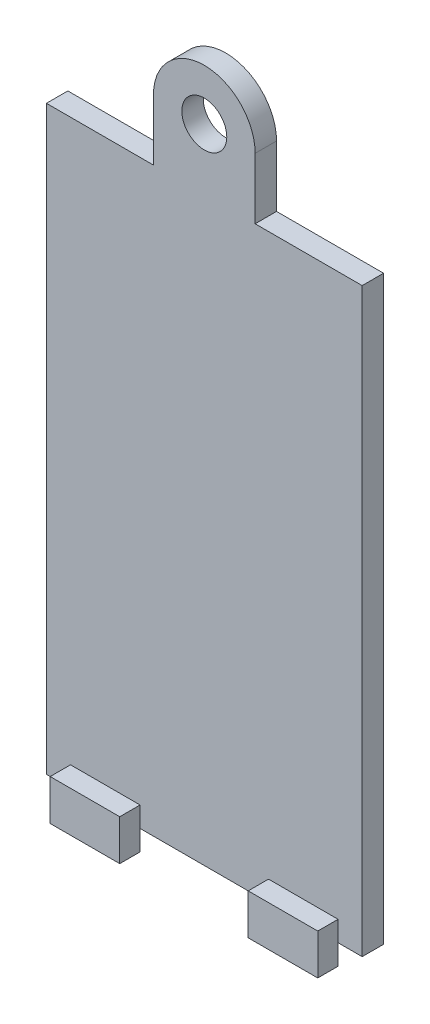
ISO-10303-21;
HEADER;
FILE_DESCRIPTION(('STEP AP214'),'2;1');
FILE_NAME('part.step','',(''),(''),'','','');
FILE_SCHEMA(('AUTOMOTIVE_DESIGN { 1 0 10303 214 1 1 1 1 }'));
ENDSEC;
DATA;
#1=APPLICATION_CONTEXT('core data for automotive mechanical design processes');
#2=APPLICATION_PROTOCOL_DEFINITION('international standard','automotive_design',2000,#1);
#3=PRODUCT_CONTEXT('',#1,'mechanical');
#4=PRODUCT('Part','Part','',(#3));
#5=PRODUCT_RELATED_PRODUCT_CATEGORY('part','',(#4));
#6=PRODUCT_DEFINITION_FORMATION('','',#4);
#7=PRODUCT_DEFINITION_CONTEXT('part definition',#1,'design');
#8=PRODUCT_DEFINITION('design','',#6,#7);
#9=PRODUCT_DEFINITION_SHAPE('','',#8);
#10=(LENGTH_UNIT() NAMED_UNIT(*) SI_UNIT(.MILLI.,.METRE.));
#11=(NAMED_UNIT(*) PLANE_ANGLE_UNIT() SI_UNIT($,.RADIAN.));
#12=(NAMED_UNIT(*) SI_UNIT($,.STERADIAN.) SOLID_ANGLE_UNIT());
#13=UNCERTAINTY_MEASURE_WITH_UNIT(LENGTH_MEASURE(1.E-05),#10,'distance_accuracy_value','');
#14=(GEOMETRIC_REPRESENTATION_CONTEXT(3) GLOBAL_UNCERTAINTY_ASSIGNED_CONTEXT((#13)) GLOBAL_UNIT_ASSIGNED_CONTEXT((#10,
#11,#12)) REPRESENTATION_CONTEXT('',''));
#15=CARTESIAN_POINT('',(0.,0.,0.));
#16=DIRECTION('',(0.,0.,1.));
#17=DIRECTION('',(1.,0.,0.));
#18=AXIS2_PLACEMENT_3D('',#15,#16,#17);
#19=CARTESIAN_POINT('',(0.,0.,2.));
#20=DIRECTION('',(0.,0.,-1.));
#21=DIRECTION('',(-1.,0.,0.));
#22=AXIS2_PLACEMENT_3D('',#19,#20,#21);
#23=PLANE('',#22);
#24=DIRECTION('',(0.,-1.,0.));
#25=VECTOR('',#24,1.);
#26=CARTESIAN_POINT('',(-4.75,32.75,2.));
#27=LINE('',#26,#25);
#28=CARTESIAN_POINT('',(-4.75,32.75,2.));
#29=VERTEX_POINT('',#28);
#30=CARTESIAN_POINT('',(-4.75,27.05,2.));
#31=VERTEX_POINT('',#30);
#32=EDGE_CURVE('E170',#29,#31,#27,.T.);
#33=ORIENTED_EDGE('',*,*,#32,.T.);
#34=DIRECTION('',(1.,0.,0.));
#35=VECTOR('',#34,1.);
#36=CARTESIAN_POINT('',(-4.75,27.05,2.));
#37=LINE('',#36,#35);
#38=CARTESIAN_POINT('',(-14.75,27.05,2.));
#39=VERTEX_POINT('',#38);
#40=EDGE_CURVE('E174',#39,#31,#37,.T.);
#41=ORIENTED_EDGE('',*,*,#40,.F.);
#42=DIRECTION('',(0.,-1.,0.));
#43=VECTOR('',#42,1.);
#44=CARTESIAN_POINT('',(-14.75,-27.25,2.));
#45=LINE('',#44,#43);
#46=CARTESIAN_POINT('',(-14.75,-27.25,2.));
#47=VERTEX_POINT('',#46);
#48=EDGE_CURVE('E336',#39,#47,#45,.T.);
#49=ORIENTED_EDGE('',*,*,#48,.T.);
#50=DIRECTION('',(1.,0.,0.));
#51=VECTOR('',#50,1.);
#52=CARTESIAN_POINT('',(14.75,-27.25,2.));
#53=LINE('',#52,#51);
#54=CARTESIAN_POINT('',(-12.5,-27.25,2.));
#55=VERTEX_POINT('',#54);
#56=EDGE_CURVE('E326',#47,#55,#53,.T.);
#57=ORIENTED_EDGE('',*,*,#56,.T.);
#58=DIRECTION('',(0.,1.,0.));
#59=VECTOR('',#58,1.);
#60=CARTESIAN_POINT('',(-12.5,-29.15,2.));
#61=LINE('',#60,#59);
#62=CARTESIAN_POINT('',(-12.5,-25.35,2.));
#63=VERTEX_POINT('',#62);
#64=EDGE_CURVE('E325',#55,#63,#61,.T.);
#65=ORIENTED_EDGE('',*,*,#64,.T.);
#66=DIRECTION('',(1.,0.,0.));
#67=VECTOR('',#66,1.);
#68=CARTESIAN_POINT('',(-12.5,-25.35,2.));
#69=LINE('',#68,#67);
#70=CARTESIAN_POINT('',(-6.,-25.35,2.));
#71=VERTEX_POINT('',#70);
#72=EDGE_CURVE('E299',#63,#71,#69,.T.);
#73=ORIENTED_EDGE('',*,*,#72,.T.);
#74=DIRECTION('',(0.,1.,0.));
#75=VECTOR('',#74,1.);
#76=CARTESIAN_POINT('',(-6.,-29.15,2.));
#77=LINE('',#76,#75);
#78=CARTESIAN_POINT('',(-6.,-27.25,2.));
#79=VERTEX_POINT('',#78);
#80=EDGE_CURVE('E320',#79,#71,#77,.T.);
#81=ORIENTED_EDGE('',*,*,#80,.F.);
#82=CARTESIAN_POINT('',(6.,-27.25,2.));
#83=VERTEX_POINT('',#82);
#84=EDGE_CURVE('E380',#79,#83,#53,.T.);
#85=ORIENTED_EDGE('',*,*,#84,.T.);
#86=DIRECTION('',(0.,1.,0.));
#87=VECTOR('',#86,1.);
#88=CARTESIAN_POINT('',(6.,-29.15,2.));
#89=LINE('',#88,#87);
#90=CARTESIAN_POINT('',(6.,-25.35,2.));
#91=VERTEX_POINT('',#90);
#92=EDGE_CURVE('E66',#83,#91,#89,.T.);
#93=ORIENTED_EDGE('',*,*,#92,.T.);
#94=DIRECTION('',(1.,0.,0.));
#95=VECTOR('',#94,1.);
#96=CARTESIAN_POINT('',(6.,-25.35,2.));
#97=LINE('',#96,#95);
#98=CARTESIAN_POINT('',(12.5,-25.35,2.));
#99=VERTEX_POINT('',#98);
#100=EDGE_CURVE('E61',#91,#99,#97,.T.);
#101=ORIENTED_EDGE('',*,*,#100,.T.);
#102=DIRECTION('',(0.,1.,0.));
#103=VECTOR('',#102,1.);
#104=CARTESIAN_POINT('',(12.5,-29.15,2.));
#105=LINE('',#104,#103);
#106=CARTESIAN_POINT('',(12.5,-27.25,2.));
#107=VERTEX_POINT('',#106);
#108=EDGE_CURVE('E272',#107,#99,#105,.T.);
#109=ORIENTED_EDGE('',*,*,#108,.F.);
#110=CARTESIAN_POINT('',(14.75,-27.25,2.));
#111=VERTEX_POINT('',#110);
#112=EDGE_CURVE('E332',#107,#111,#53,.T.);
#113=ORIENTED_EDGE('',*,*,#112,.T.);
#114=DIRECTION('',(0.,1.,0.));
#115=VECTOR('',#114,1.);
#116=CARTESIAN_POINT('',(14.75,-27.25,2.));
#117=LINE('',#116,#115);
#118=CARTESIAN_POINT('',(14.75,27.05,2.));
#119=VERTEX_POINT('',#118);
#120=EDGE_CURVE('E330',#111,#119,#117,.T.);
#121=ORIENTED_EDGE('',*,*,#120,.T.);
#122=DIRECTION('',(1.,0.,0.));
#123=VECTOR('',#122,1.);
#124=CARTESIAN_POINT('',(4.75,27.05,2.));
#125=LINE('',#124,#123);
#126=CARTESIAN_POINT('',(4.75,27.05,2.));
#127=VERTEX_POINT('',#126);
#128=EDGE_CURVE('E197',#127,#119,#125,.T.);
#129=ORIENTED_EDGE('',*,*,#128,.F.);
#130=DIRECTION('',(0.,1.,0.));
#131=VECTOR('',#130,1.);
#132=CARTESIAN_POINT('',(4.75,27.25,2.));
#133=LINE('',#132,#131);
#134=CARTESIAN_POINT('',(4.75,32.75,2.));
#135=VERTEX_POINT('',#134);
#136=EDGE_CURVE('E181',#127,#135,#133,.T.);
#137=ORIENTED_EDGE('',*,*,#136,.T.);
#138=CARTESIAN_POINT('',(0.,32.75,2.));
#139=DIRECTION('',(0.,0.,1.));
#140=DIRECTION('',(1.,0.,0.));
#141=AXIS2_PLACEMENT_3D('',#138,#139,#140);
#142=CIRCLE('',#141,4.75);
#143=EDGE_CURVE('E178',#135,#29,#142,.T.);
#144=ORIENTED_EDGE('',*,*,#143,.T.);
#145=EDGE_LOOP('',(#33,#41,#49,#57,#65,#73,#81,#85,#93,#101,#109,#113,#121,#129,#137,#144));
#146=FACE_BOUND('',#145,.T.);
#147=CARTESIAN_POINT('',(0.,32.75,2.));
#148=DIRECTION('',(0.,0.,1.));
#149=DIRECTION('',(1.,0.,0.));
#150=AXIS2_PLACEMENT_3D('',#147,#148,#149);
#151=CIRCLE('',#150,2.1);
#152=CARTESIAN_POINT('',(2.1,32.75,2.));
#153=VERTEX_POINT('',#152);
#154=EDGE_CURVE('E211',#153,#153,#151,.T.);
#155=ORIENTED_EDGE('',*,*,#154,.F.);
#156=EDGE_LOOP('',(#155));
#157=FACE_BOUND('',#156,.T.);
#158=ADVANCED_FACE('F45',(#146,#157),#23,.F.);
#159=CARTESIAN_POINT('',(14.75,-27.25,2.));
#160=DIRECTION('',(0.,1.,0.));
#161=DIRECTION('',(0.,0.,1.));
#162=AXIS2_PLACEMENT_3D('',#159,#160,#161);
#163=PLANE('',#162);
#164=DIRECTION('',(1.,0.,0.));
#165=VECTOR('',#164,1.);
#166=CARTESIAN_POINT('',(14.75,-27.25,0.));
#167=LINE('',#166,#165);
#168=CARTESIAN_POINT('',(-14.75,-27.25,0.));
#169=VERTEX_POINT('',#168);
#170=CARTESIAN_POINT('',(14.75,-27.25,0.));
#171=VERTEX_POINT('',#170);
#172=EDGE_CURVE('E324',#169,#171,#167,.T.);
#173=ORIENTED_EDGE('',*,*,#172,.T.);
#174=DIRECTION('',(0.,0.,-1.));
#175=VECTOR('',#174,1.);
#176=CARTESIAN_POINT('',(14.75,-27.25,2.));
#177=LINE('',#176,#175);
#178=EDGE_CURVE('E353',#111,#171,#177,.T.);
#179=ORIENTED_EDGE('',*,*,#178,.F.);
#180=ORIENTED_EDGE('',*,*,#112,.F.);
#181=EDGE_CURVE('E383',#83,#107,#53,.T.);
#182=ORIENTED_EDGE('',*,*,#181,.F.);
#183=ORIENTED_EDGE('',*,*,#84,.F.);
#184=EDGE_CURVE('E331',#55,#79,#53,.T.);
#185=ORIENTED_EDGE('',*,*,#184,.F.);
#186=ORIENTED_EDGE('',*,*,#56,.F.);
#187=DIRECTION('',(0.,0.,-1.));
#188=VECTOR('',#187,1.);
#189=CARTESIAN_POINT('',(-14.75,-27.25,2.));
#190=LINE('',#189,#188);
#191=EDGE_CURVE('E339',#47,#169,#190,.T.);
#192=ORIENTED_EDGE('',*,*,#191,.T.);
#193=EDGE_LOOP('',(#173,#179,#180,#182,#183,#185,#186,#192));
#194=FACE_BOUND('',#193,.T.);
#195=ADVANCED_FACE('F47',(#194),#163,.F.);
#196=CARTESIAN_POINT('',(14.75,-27.25,2.));
#197=DIRECTION('',(-1.,0.,0.));
#198=DIRECTION('',(0.,0.,1.));
#199=AXIS2_PLACEMENT_3D('',#196,#197,#198);
#200=PLANE('',#199);
#201=DIRECTION('',(0.,1.,0.));
#202=VECTOR('',#201,1.);
#203=CARTESIAN_POINT('',(14.75,-27.25,0.));
#204=LINE('',#203,#202);
#205=CARTESIAN_POINT('',(14.75,27.05,0.));
#206=VERTEX_POINT('',#205);
#207=EDGE_CURVE('E343',#171,#206,#204,.T.);
#208=ORIENTED_EDGE('',*,*,#207,.T.);
#209=DIRECTION('',(0.,0.,1.));
#210=VECTOR('',#209,1.);
#211=CARTESIAN_POINT('',(14.75,27.05,2.));
#212=LINE('',#211,#210);
#213=EDGE_CURVE('E191',#206,#119,#212,.T.);
#214=ORIENTED_EDGE('',*,*,#213,.T.);
#215=ORIENTED_EDGE('',*,*,#120,.F.);
#216=ORIENTED_EDGE('',*,*,#178,.T.);
#217=EDGE_LOOP('',(#208,#214,#215,#216));
#218=FACE_BOUND('',#217,.T.);
#219=ADVANCED_FACE('F393',(#218),#200,.F.);
#220=CARTESIAN_POINT('',(-14.75,-27.25,2.));
#221=DIRECTION('',(1.,0.,0.));
#222=DIRECTION('',(0.,0.,-1.));
#223=AXIS2_PLACEMENT_3D('',#220,#221,#222);
#224=PLANE('',#223);
#225=ORIENTED_EDGE('',*,*,#48,.F.);
#226=DIRECTION('',(0.,0.,-1.));
#227=VECTOR('',#226,1.);
#228=CARTESIAN_POINT('',(-14.75,27.05,2.));
#229=LINE('',#228,#227);
#230=CARTESIAN_POINT('',(-14.75,27.05,0.));
#231=VERTEX_POINT('',#230);
#232=EDGE_CURVE('E195',#39,#231,#229,.T.);
#233=ORIENTED_EDGE('',*,*,#232,.T.);
#234=DIRECTION('',(0.,-1.,0.));
#235=VECTOR('',#234,1.);
#236=CARTESIAN_POINT('',(-14.75,-27.25,0.));
#237=LINE('',#236,#235);
#238=EDGE_CURVE('E347',#231,#169,#237,.T.);
#239=ORIENTED_EDGE('',*,*,#238,.T.);
#240=ORIENTED_EDGE('',*,*,#191,.F.);
#241=EDGE_LOOP('',(#225,#233,#239,#240));
#242=FACE_BOUND('',#241,.T.);
#243=ADVANCED_FACE('F424',(#242),#224,.F.);
#244=CARTESIAN_POINT('',(0.,0.,0.));
#245=DIRECTION('',(0.,0.,-1.));
#246=DIRECTION('',(-1.,0.,0.));
#247=AXIS2_PLACEMENT_3D('',#244,#245,#246);
#248=PLANE('',#247);
#249=DIRECTION('',(-1.,0.,0.));
#250=VECTOR('',#249,1.);
#251=CARTESIAN_POINT('',(0.,27.05,0.));
#252=LINE('',#251,#250);
#253=CARTESIAN_POINT('',(-4.75,27.05,0.));
#254=VERTEX_POINT('',#253);
#255=EDGE_CURVE('E11',#254,#231,#252,.T.);
#256=ORIENTED_EDGE('',*,*,#255,.F.);
#257=DIRECTION('',(0.,-1.,0.));
#258=VECTOR('',#257,1.);
#259=CARTESIAN_POINT('',(-4.75,32.75,0.));
#260=LINE('',#259,#258);
#261=CARTESIAN_POINT('',(-4.75,32.75,0.));
#262=VERTEX_POINT('',#261);
#263=EDGE_CURVE('E187',#262,#254,#260,.T.);
#264=ORIENTED_EDGE('',*,*,#263,.F.);
#265=CARTESIAN_POINT('',(0.,32.75,0.));
#266=DIRECTION('',(0.,0.,1.));
#267=DIRECTION('',(1.,0.,0.));
#268=AXIS2_PLACEMENT_3D('',#265,#266,#267);
#269=CIRCLE('',#268,4.75);
#270=CARTESIAN_POINT('',(4.75,32.75,0.));
#271=VERTEX_POINT('',#270);
#272=EDGE_CURVE('E219',#271,#262,#269,.T.);
#273=ORIENTED_EDGE('',*,*,#272,.F.);
#274=DIRECTION('',(0.,1.,0.));
#275=VECTOR('',#274,1.);
#276=CARTESIAN_POINT('',(4.75,27.25,0.));
#277=LINE('',#276,#275);
#278=CARTESIAN_POINT('',(4.75,27.05,0.));
#279=VERTEX_POINT('',#278);
#280=EDGE_CURVE('E225',#279,#271,#277,.T.);
#281=ORIENTED_EDGE('',*,*,#280,.F.);
#282=DIRECTION('',(-1.,0.,0.));
#283=VECTOR('',#282,1.);
#284=CARTESIAN_POINT('',(0.,27.05,0.));
#285=LINE('',#284,#283);
#286=EDGE_CURVE('E54',#206,#279,#285,.T.);
#287=ORIENTED_EDGE('',*,*,#286,.F.);
#288=ORIENTED_EDGE('',*,*,#207,.F.);
#289=ORIENTED_EDGE('',*,*,#172,.F.);
#290=ORIENTED_EDGE('',*,*,#238,.F.);
#291=EDGE_LOOP('',(#256,#264,#273,#281,#287,#288,#289,#290));
#292=FACE_BOUND('',#291,.T.);
#293=CARTESIAN_POINT('',(0.,32.75,0.));
#294=DIRECTION('',(0.,0.,1.));
#295=DIRECTION('',(1.,0.,0.));
#296=AXIS2_PLACEMENT_3D('',#293,#294,#295);
#297=CIRCLE('',#296,2.1);
#298=CARTESIAN_POINT('',(2.1,32.75,0.));
#299=VERTEX_POINT('',#298);
#300=EDGE_CURVE('E212',#299,#299,#297,.T.);
#301=ORIENTED_EDGE('',*,*,#300,.T.);
#302=EDGE_LOOP('',(#301));
#303=FACE_BOUND('',#302,.T.);
#304=ADVANCED_FACE('F398',(#292,#303),#248,.T.);
#305=CARTESIAN_POINT('',(-12.5,-29.15,2.));
#306=DIRECTION('',(0.,0.,1.));
#307=DIRECTION('',(1.,0.,0.));
#308=AXIS2_PLACEMENT_3D('',#305,#306,#307);
#309=PLANE('',#308);
#310=CARTESIAN_POINT('',(-12.5,-29.15,2.));
#311=VERTEX_POINT('',#310);
#312=EDGE_CURVE('E319',#311,#55,#61,.T.);
#313=ORIENTED_EDGE('',*,*,#312,.T.);
#314=ORIENTED_EDGE('',*,*,#184,.T.);
#315=CARTESIAN_POINT('',(-6.,-29.15,2.));
#316=VERTEX_POINT('',#315);
#317=EDGE_CURVE('E315',#316,#79,#77,.T.);
#318=ORIENTED_EDGE('',*,*,#317,.F.);
#319=DIRECTION('',(1.,0.,0.));
#320=VECTOR('',#319,1.);
#321=CARTESIAN_POINT('',(-12.5,-29.15,2.));
#322=LINE('',#321,#320);
#323=EDGE_CURVE('E286',#311,#316,#322,.T.);
#324=ORIENTED_EDGE('',*,*,#323,.F.);
#325=EDGE_LOOP('',(#313,#314,#318,#324));
#326=FACE_BOUND('',#325,.T.);
#327=ADVANCED_FACE('F376',(#326),#309,.F.);
#328=CARTESIAN_POINT('',(-12.5,-29.15,2.));
#329=DIRECTION('',(1.,0.,0.));
#330=DIRECTION('',(0.,0.,-1.));
#331=AXIS2_PLACEMENT_3D('',#328,#329,#330);
#332=PLANE('',#331);
#333=DIRECTION('',(0.,0.,-1.));
#334=VECTOR('',#333,1.);
#335=CARTESIAN_POINT('',(-12.5,-25.35,2.));
#336=LINE('',#335,#334);
#337=CARTESIAN_POINT('',(-12.5,-25.35,3.9));
#338=VERTEX_POINT('',#337);
#339=EDGE_CURVE('E281',#338,#63,#336,.T.);
#340=ORIENTED_EDGE('',*,*,#339,.T.);
#341=ORIENTED_EDGE('',*,*,#64,.F.);
#342=ORIENTED_EDGE('',*,*,#312,.F.);
#343=DIRECTION('',(0.,0.,-1.));
#344=VECTOR('',#343,1.);
#345=CARTESIAN_POINT('',(-12.5,-29.15,2.));
#346=LINE('',#345,#344);
#347=CARTESIAN_POINT('',(-12.5,-29.15,3.9));
#348=VERTEX_POINT('',#347);
#349=EDGE_CURVE('E282',#348,#311,#346,.T.);
#350=ORIENTED_EDGE('',*,*,#349,.F.);
#351=DIRECTION('',(0.,1.,0.));
#352=VECTOR('',#351,1.);
#353=CARTESIAN_POINT('',(-12.5,-29.15,3.9));
#354=LINE('',#353,#352);
#355=EDGE_CURVE('E296',#348,#338,#354,.T.);
#356=ORIENTED_EDGE('',*,*,#355,.T.);
#357=EDGE_LOOP('',(#340,#341,#342,#350,#356));
#358=FACE_BOUND('',#357,.T.);
#359=ADVANCED_FACE('F371',(#358),#332,.F.);
#360=CARTESIAN_POINT('',(-6.,-29.15,2.));
#361=DIRECTION('',(-1.,0.,0.));
#362=DIRECTION('',(0.,0.,1.));
#363=AXIS2_PLACEMENT_3D('',#360,#361,#362);
#364=PLANE('',#363);
#365=DIRECTION('',(0.,0.,1.));
#366=VECTOR('',#365,1.);
#367=CARTESIAN_POINT('',(-6.,-25.35,2.));
#368=LINE('',#367,#366);
#369=CARTESIAN_POINT('',(-6.,-25.35,3.9));
#370=VERTEX_POINT('',#369);
#371=EDGE_CURVE('E303',#71,#370,#368,.T.);
#372=ORIENTED_EDGE('',*,*,#371,.T.);
#373=DIRECTION('',(0.,1.,0.));
#374=VECTOR('',#373,1.);
#375=CARTESIAN_POINT('',(-6.,-29.15,3.9));
#376=LINE('',#375,#374);
#377=CARTESIAN_POINT('',(-6.,-29.15,3.9));
#378=VERTEX_POINT('',#377);
#379=EDGE_CURVE('E311',#378,#370,#376,.T.);
#380=ORIENTED_EDGE('',*,*,#379,.F.);
#381=DIRECTION('',(0.,0.,1.));
#382=VECTOR('',#381,1.);
#383=CARTESIAN_POINT('',(-6.,-29.15,2.));
#384=LINE('',#383,#382);
#385=EDGE_CURVE('E290',#316,#378,#384,.T.);
#386=ORIENTED_EDGE('',*,*,#385,.F.);
#387=ORIENTED_EDGE('',*,*,#317,.T.);
#388=ORIENTED_EDGE('',*,*,#80,.T.);
#389=EDGE_LOOP('',(#372,#380,#386,#387,#388));
#390=FACE_BOUND('',#389,.T.);
#391=ADVANCED_FACE('F572',(#390),#364,.F.);
#392=CARTESIAN_POINT('',(-12.5,-29.15,3.9));
#393=DIRECTION('',(0.,0.,-1.));
#394=DIRECTION('',(-1.,0.,0.));
#395=AXIS2_PLACEMENT_3D('',#392,#393,#394);
#396=PLANE('',#395);
#397=DIRECTION('',(-1.,0.,0.));
#398=VECTOR('',#397,1.);
#399=CARTESIAN_POINT('',(-12.5,-25.35,3.9));
#400=LINE('',#399,#398);
#401=EDGE_CURVE('E287',#370,#338,#400,.T.);
#402=ORIENTED_EDGE('',*,*,#401,.T.);
#403=ORIENTED_EDGE('',*,*,#355,.F.);
#404=DIRECTION('',(-1.,0.,0.));
#405=VECTOR('',#404,1.);
#406=CARTESIAN_POINT('',(-12.5,-29.15,3.9));
#407=LINE('',#406,#405);
#408=EDGE_CURVE('E293',#378,#348,#407,.T.);
#409=ORIENTED_EDGE('',*,*,#408,.F.);
#410=ORIENTED_EDGE('',*,*,#379,.T.);
#411=EDGE_LOOP('',(#402,#403,#409,#410));
#412=FACE_BOUND('',#411,.T.);
#413=ADVANCED_FACE('F563',(#412),#396,.F.);
#414=CARTESIAN_POINT('',(0.,-29.15,0.));
#415=DIRECTION('',(0.,1.,0.));
#416=DIRECTION('',(0.,0.,1.));
#417=AXIS2_PLACEMENT_3D('',#414,#415,#416);
#418=PLANE('',#417);
#419=ORIENTED_EDGE('',*,*,#349,.T.);
#420=ORIENTED_EDGE('',*,*,#323,.T.);
#421=ORIENTED_EDGE('',*,*,#385,.T.);
#422=ORIENTED_EDGE('',*,*,#408,.T.);
#423=EDGE_LOOP('',(#419,#420,#421,#422));
#424=FACE_BOUND('',#423,.T.);
#425=ADVANCED_FACE('F554',(#424),#418,.F.);
#426=CARTESIAN_POINT('',(0.,-25.35,0.));
#427=DIRECTION('',(0.,1.,0.));
#428=DIRECTION('',(0.,0.,1.));
#429=AXIS2_PLACEMENT_3D('',#426,#427,#428);
#430=PLANE('',#429);
#431=ORIENTED_EDGE('',*,*,#339,.F.);
#432=ORIENTED_EDGE('',*,*,#401,.F.);
#433=ORIENTED_EDGE('',*,*,#371,.F.);
#434=ORIENTED_EDGE('',*,*,#72,.F.);
#435=EDGE_LOOP('',(#431,#432,#433,#434));
#436=FACE_BOUND('',#435,.T.);
#437=ADVANCED_FACE('F541',(#436),#430,.T.);
#438=CARTESIAN_POINT('',(6.,-29.15,2.));
#439=DIRECTION('',(0.,0.,1.));
#440=DIRECTION('',(1.,0.,0.));
#441=AXIS2_PLACEMENT_3D('',#438,#439,#440);
#442=PLANE('',#441);
#443=CARTESIAN_POINT('',(6.,-29.15,2.));
#444=VERTEX_POINT('',#443);
#445=EDGE_CURVE('E277',#444,#83,#89,.T.);
#446=ORIENTED_EDGE('',*,*,#445,.T.);
#447=ORIENTED_EDGE('',*,*,#181,.T.);
#448=CARTESIAN_POINT('',(12.5,-29.15,2.));
#449=VERTEX_POINT('',#448);
#450=EDGE_CURVE('E273',#449,#107,#105,.T.);
#451=ORIENTED_EDGE('',*,*,#450,.F.);
#452=DIRECTION('',(1.,0.,0.));
#453=VECTOR('',#452,1.);
#454=CARTESIAN_POINT('',(6.,-29.15,2.));
#455=LINE('',#454,#453);
#456=EDGE_CURVE('E244',#444,#449,#455,.T.);
#457=ORIENTED_EDGE('',*,*,#456,.F.);
#458=EDGE_LOOP('',(#446,#447,#451,#457));
#459=FACE_BOUND('',#458,.T.);
#460=ADVANCED_FACE('F532',(#459),#442,.F.);
#461=CARTESIAN_POINT('',(6.,-29.15,2.));
#462=DIRECTION('',(1.,0.,0.));
#463=DIRECTION('',(0.,0.,-1.));
#464=AXIS2_PLACEMENT_3D('',#461,#462,#463);
#465=PLANE('',#464);
#466=DIRECTION('',(0.,0.,-1.));
#467=VECTOR('',#466,1.);
#468=CARTESIAN_POINT('',(6.,-25.35,2.));
#469=LINE('',#468,#467);
#470=CARTESIAN_POINT('',(6.,-25.35,3.9));
#471=VERTEX_POINT('',#470);
#472=EDGE_CURVE('E237',#471,#91,#469,.T.);
#473=ORIENTED_EDGE('',*,*,#472,.T.);
#474=ORIENTED_EDGE('',*,*,#92,.F.);
#475=ORIENTED_EDGE('',*,*,#445,.F.);
#476=DIRECTION('',(0.,0.,-1.));
#477=VECTOR('',#476,1.);
#478=CARTESIAN_POINT('',(6.,-29.15,2.));
#479=LINE('',#478,#477);
#480=CARTESIAN_POINT('',(6.,-29.15,3.9));
#481=VERTEX_POINT('',#480);
#482=EDGE_CURVE('E240',#481,#444,#479,.T.);
#483=ORIENTED_EDGE('',*,*,#482,.F.);
#484=DIRECTION('',(0.,1.,0.));
#485=VECTOR('',#484,1.);
#486=CARTESIAN_POINT('',(6.,-29.15,3.9));
#487=LINE('',#486,#485);
#488=EDGE_CURVE('E254',#481,#471,#487,.T.);
#489=ORIENTED_EDGE('',*,*,#488,.T.);
#490=EDGE_LOOP('',(#473,#474,#475,#483,#489));
#491=FACE_BOUND('',#490,.T.);
#492=ADVANCED_FACE('F523',(#491),#465,.F.);
#493=CARTESIAN_POINT('',(12.5,-29.15,2.));
#494=DIRECTION('',(-1.,0.,0.));
#495=DIRECTION('',(0.,0.,1.));
#496=AXIS2_PLACEMENT_3D('',#493,#494,#495);
#497=PLANE('',#496);
#498=DIRECTION('',(0.,0.,1.));
#499=VECTOR('',#498,1.);
#500=CARTESIAN_POINT('',(12.5,-25.35,2.));
#501=LINE('',#500,#499);
#502=CARTESIAN_POINT('',(12.5,-25.35,3.9));
#503=VERTEX_POINT('',#502);
#504=EDGE_CURVE('E260',#99,#503,#501,.T.);
#505=ORIENTED_EDGE('',*,*,#504,.T.);
#506=DIRECTION('',(0.,1.,0.));
#507=VECTOR('',#506,1.);
#508=CARTESIAN_POINT('',(12.5,-29.15,3.9));
#509=LINE('',#508,#507);
#510=CARTESIAN_POINT('',(12.5,-29.15,3.9));
#511=VERTEX_POINT('',#510);
#512=EDGE_CURVE('E268',#511,#503,#509,.T.);
#513=ORIENTED_EDGE('',*,*,#512,.F.);
#514=DIRECTION('',(0.,0.,1.));
#515=VECTOR('',#514,1.);
#516=CARTESIAN_POINT('',(12.5,-29.15,2.));
#517=LINE('',#516,#515);
#518=EDGE_CURVE('E248',#449,#511,#517,.T.);
#519=ORIENTED_EDGE('',*,*,#518,.F.);
#520=ORIENTED_EDGE('',*,*,#450,.T.);
#521=ORIENTED_EDGE('',*,*,#108,.T.);
#522=EDGE_LOOP('',(#505,#513,#519,#520,#521));
#523=FACE_BOUND('',#522,.T.);
#524=ADVANCED_FACE('F514',(#523),#497,.F.);
#525=CARTESIAN_POINT('',(6.,-29.15,3.9));
#526=DIRECTION('',(0.,0.,-1.));
#527=DIRECTION('',(-1.,0.,0.));
#528=AXIS2_PLACEMENT_3D('',#525,#526,#527);
#529=PLANE('',#528);
#530=DIRECTION('',(-1.,0.,0.));
#531=VECTOR('',#530,1.);
#532=CARTESIAN_POINT('',(6.,-25.35,3.9));
#533=LINE('',#532,#531);
#534=EDGE_CURVE('E245',#503,#471,#533,.T.);
#535=ORIENTED_EDGE('',*,*,#534,.T.);
#536=ORIENTED_EDGE('',*,*,#488,.F.);
#537=DIRECTION('',(-1.,0.,0.));
#538=VECTOR('',#537,1.);
#539=CARTESIAN_POINT('',(6.,-29.15,3.9));
#540=LINE('',#539,#538);
#541=EDGE_CURVE('E251',#511,#481,#540,.T.);
#542=ORIENTED_EDGE('',*,*,#541,.F.);
#543=ORIENTED_EDGE('',*,*,#512,.T.);
#544=EDGE_LOOP('',(#535,#536,#542,#543));
#545=FACE_BOUND('',#544,.T.);
#546=ADVANCED_FACE('F505',(#545),#529,.F.);
#547=CARTESIAN_POINT('',(0.,-29.15,0.));
#548=DIRECTION('',(0.,1.,0.));
#549=DIRECTION('',(0.,0.,1.));
#550=AXIS2_PLACEMENT_3D('',#547,#548,#549);
#551=PLANE('',#550);
#552=ORIENTED_EDGE('',*,*,#482,.T.);
#553=ORIENTED_EDGE('',*,*,#456,.T.);
#554=ORIENTED_EDGE('',*,*,#518,.T.);
#555=ORIENTED_EDGE('',*,*,#541,.T.);
#556=EDGE_LOOP('',(#552,#553,#554,#555));
#557=FACE_BOUND('',#556,.T.);
#558=ADVANCED_FACE('F496',(#557),#551,.F.);
#559=CARTESIAN_POINT('',(0.,-25.35,0.));
#560=DIRECTION('',(0.,1.,0.));
#561=DIRECTION('',(0.,0.,1.));
#562=AXIS2_PLACEMENT_3D('',#559,#560,#561);
#563=PLANE('',#562);
#564=ORIENTED_EDGE('',*,*,#472,.F.);
#565=ORIENTED_EDGE('',*,*,#534,.F.);
#566=ORIENTED_EDGE('',*,*,#504,.F.);
#567=ORIENTED_EDGE('',*,*,#100,.F.);
#568=EDGE_LOOP('',(#564,#565,#566,#567));
#569=FACE_BOUND('',#568,.T.);
#570=ADVANCED_FACE('F487',(#569),#563,.T.);
#571=CARTESIAN_POINT('',(0.,32.75,0.));
#572=DIRECTION('',(0.,0.,1.));
#573=DIRECTION('',(1.,0.,0.));
#574=AXIS2_PLACEMENT_3D('',#571,#572,#573);
#575=CYLINDRICAL_SURFACE('',#574,4.75);
#576=ORIENTED_EDGE('',*,*,#143,.F.);
#577=DIRECTION('',(0.,0.,1.));
#578=VECTOR('',#577,1.);
#579=CARTESIAN_POINT('',(4.75,32.75,0.));
#580=LINE('',#579,#578);
#581=EDGE_CURVE('E234',#271,#135,#580,.T.);
#582=ORIENTED_EDGE('',*,*,#581,.F.);
#583=ORIENTED_EDGE('',*,*,#272,.T.);
#584=DIRECTION('',(0.,0.,1.));
#585=VECTOR('',#584,1.);
#586=CARTESIAN_POINT('',(-4.75,32.75,0.));
#587=LINE('',#586,#585);
#588=EDGE_CURVE('E229',#262,#29,#587,.T.);
#589=ORIENTED_EDGE('',*,*,#588,.T.);
#590=EDGE_LOOP('',(#576,#582,#583,#589));
#591=FACE_BOUND('',#590,.T.);
#592=ADVANCED_FACE('F448',(#591),#575,.T.);
#593=CARTESIAN_POINT('',(4.75,27.25,0.));
#594=DIRECTION('',(1.,0.,0.));
#595=DIRECTION('',(0.,0.,-1.));
#596=AXIS2_PLACEMENT_3D('',#593,#594,#595);
#597=PLANE('',#596);
#598=ORIENTED_EDGE('',*,*,#136,.F.);
#599=DIRECTION('',(0.,0.,1.));
#600=VECTOR('',#599,1.);
#601=CARTESIAN_POINT('',(4.75,27.05,-8.));
#602=LINE('',#601,#600);
#603=EDGE_CURVE('E200',#279,#127,#602,.T.);
#604=ORIENTED_EDGE('',*,*,#603,.F.);
#605=ORIENTED_EDGE('',*,*,#280,.T.);
#606=ORIENTED_EDGE('',*,*,#581,.T.);
#607=EDGE_LOOP('',(#598,#604,#605,#606));
#608=FACE_BOUND('',#607,.T.);
#609=ADVANCED_FACE('F402',(#608),#597,.T.);
#610=CARTESIAN_POINT('',(-4.75,32.75,0.));
#611=DIRECTION('',(-1.,0.,0.));
#612=DIRECTION('',(0.,-1.,0.));
#613=AXIS2_PLACEMENT_3D('',#610,#611,#612);
#614=PLANE('',#613);
#615=ORIENTED_EDGE('',*,*,#32,.F.);
#616=ORIENTED_EDGE('',*,*,#588,.F.);
#617=ORIENTED_EDGE('',*,*,#263,.T.);
#618=DIRECTION('',(0.,0.,1.));
#619=VECTOR('',#618,1.);
#620=CARTESIAN_POINT('',(-4.75,27.05,-8.));
#621=LINE('',#620,#619);
#622=EDGE_CURVE('E184',#254,#31,#621,.T.);
#623=ORIENTED_EDGE('',*,*,#622,.T.);
#624=EDGE_LOOP('',(#615,#616,#617,#623));
#625=FACE_BOUND('',#624,.T.);
#626=ADVANCED_FACE('F185',(#625),#614,.T.);
#627=CARTESIAN_POINT('',(0.,32.75,0.));
#628=DIRECTION('',(0.,0.,1.));
#629=DIRECTION('',(1.,0.,0.));
#630=AXIS2_PLACEMENT_3D('',#627,#628,#629);
#631=CYLINDRICAL_SURFACE('',#630,2.1);
#632=ORIENTED_EDGE('',*,*,#300,.F.);
#633=EDGE_LOOP('',(#632));
#634=FACE_BOUND('',#633,.T.);
#635=ORIENTED_EDGE('',*,*,#154,.T.);
#636=EDGE_LOOP('',(#635));
#637=FACE_BOUND('',#636,.T.);
#638=ADVANCED_FACE('F409',(#634,#637),#631,.F.);
#639=CARTESIAN_POINT('',(-4.75,27.05,-8.));
#640=DIRECTION('',(0.,-1.,0.));
#641=DIRECTION('',(1.,0.,0.));
#642=AXIS2_PLACEMENT_3D('',#639,#640,#641);
#643=PLANE('',#642);
#644=ORIENTED_EDGE('',*,*,#40,.T.);
#645=ORIENTED_EDGE('',*,*,#622,.F.);
#646=ORIENTED_EDGE('',*,*,#255,.T.);
#647=ORIENTED_EDGE('',*,*,#232,.F.);
#648=EDGE_LOOP('',(#644,#645,#646,#647));
#649=FACE_BOUND('',#648,.T.);
#650=ADVANCED_FACE('F193',(#649),#643,.F.);
#651=CARTESIAN_POINT('',(4.75,27.05,-8.));
#652=DIRECTION('',(0.,-1.,0.));
#653=DIRECTION('',(0.,0.,-1.));
#654=AXIS2_PLACEMENT_3D('',#651,#652,#653);
#655=PLANE('',#654);
#656=ORIENTED_EDGE('',*,*,#286,.T.);
#657=ORIENTED_EDGE('',*,*,#603,.T.);
#658=ORIENTED_EDGE('',*,*,#128,.T.);
#659=ORIENTED_EDGE('',*,*,#213,.F.);
#660=EDGE_LOOP('',(#656,#657,#658,#659));
#661=FACE_BOUND('',#660,.T.);
#662=ADVANCED_FACE('F403',(#661),#655,.F.);
#663=CLOSED_SHELL('',(#158,#195,#219,#243,#304,#327,#359,#391,#413,#425,#437,#460,#492,#524,
#546,#558,#570,#592,#609,#626,#638,#650,#662));
#664=MANIFOLD_SOLID_BREP('B2',#663);
#665=ADVANCED_BREP_SHAPE_REPRESENTATION('',(#18,#664),#14);
#666=SHAPE_DEFINITION_REPRESENTATION(#9,#665);
ENDSEC;
END-ISO-10303-21;
